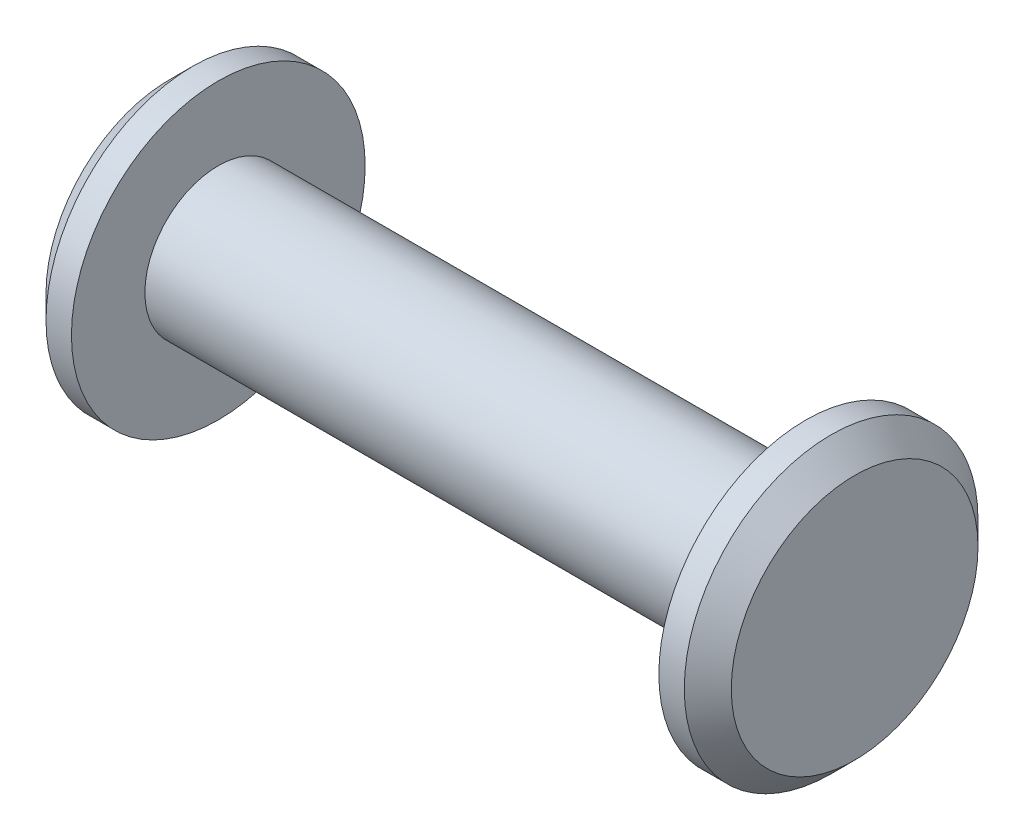
ISO-10303-21;
HEADER;
FILE_DESCRIPTION(('STEP AP214'),'2;1');
FILE_NAME('part.step','',(''),(''),'','','');
FILE_SCHEMA(('AUTOMOTIVE_DESIGN { 1 0 10303 214 1 1 1 1 }'));
ENDSEC;
DATA;
#1=APPLICATION_CONTEXT('core data for automotive mechanical design processes');
#2=APPLICATION_PROTOCOL_DEFINITION('international standard','automotive_design',2000,#1);
#3=PRODUCT_CONTEXT('',#1,'mechanical');
#4=PRODUCT('Part','Part','',(#3));
#5=PRODUCT_RELATED_PRODUCT_CATEGORY('part','',(#4));
#6=PRODUCT_DEFINITION_FORMATION('','',#4);
#7=PRODUCT_DEFINITION_CONTEXT('part definition',#1,'design');
#8=PRODUCT_DEFINITION('design','',#6,#7);
#9=PRODUCT_DEFINITION_SHAPE('','',#8);
#10=(LENGTH_UNIT() NAMED_UNIT(*) SI_UNIT(.MILLI.,.METRE.));
#11=(NAMED_UNIT(*) PLANE_ANGLE_UNIT() SI_UNIT($,.RADIAN.));
#12=(NAMED_UNIT(*) SI_UNIT($,.STERADIAN.) SOLID_ANGLE_UNIT());
#13=UNCERTAINTY_MEASURE_WITH_UNIT(LENGTH_MEASURE(1.E-05),#10,'distance_accuracy_value','');
#14=(GEOMETRIC_REPRESENTATION_CONTEXT(3) GLOBAL_UNCERTAINTY_ASSIGNED_CONTEXT((#13)) GLOBAL_UNIT_ASSIGNED_CONTEXT((#10,
#11,#12)) REPRESENTATION_CONTEXT('',''));
#15=CARTESIAN_POINT('',(0.,0.,0.));
#16=DIRECTION('',(0.,0.,1.));
#17=DIRECTION('',(1.,0.,0.));
#18=AXIS2_PLACEMENT_3D('',#15,#16,#17);
#19=CARTESIAN_POINT('',(0.,0.,0.));
#20=DIRECTION('',(-1.,0.,0.));
#21=DIRECTION('',(0.,0.,1.));
#22=AXIS2_PLACEMENT_3D('',#19,#20,#21);
#23=CYLINDRICAL_SURFACE('',#22,4.7625);
#24=CARTESIAN_POINT('',(10.3505,0.,0.));
#25=DIRECTION('',(-1.,0.,0.));
#26=DIRECTION('',(0.,0.,1.));
#27=AXIS2_PLACEMENT_3D('',#24,#25,#26);
#28=CIRCLE('',#27,4.7625);
#29=CARTESIAN_POINT('',(10.3505,0.,4.76249999999997));
#30=VERTEX_POINT('',#29);
#31=EDGE_CURVE('E46',#30,#30,#28,.T.);
#32=ORIENTED_EDGE('',*,*,#31,.T.);
#33=EDGE_LOOP('',(#32));
#34=FACE_BOUND('',#33,.T.);
#35=CARTESIAN_POINT('',(9.52499999999997,0.,0.));
#36=DIRECTION('',(-1.,0.,0.));
#37=DIRECTION('',(0.,0.,1.));
#38=AXIS2_PLACEMENT_3D('',#35,#36,#37);
#39=CIRCLE('',#38,4.7625);
#40=CARTESIAN_POINT('',(9.52499999999997,0.,4.76249999999999));
#41=VERTEX_POINT('',#40);
#42=EDGE_CURVE('E51',#41,#41,#39,.T.);
#43=ORIENTED_EDGE('',*,*,#42,.F.);
#44=EDGE_LOOP('',(#43));
#45=FACE_BOUND('',#44,.T.);
#46=ADVANCED_FACE('F32',(#34,#45),#23,.T.);
#47=CARTESIAN_POINT('',(9.52500000000001,4.7625,0.));
#48=DIRECTION('',(1.,0.,0.));
#49=DIRECTION('',(0.,0.,-1.));
#50=AXIS2_PLACEMENT_3D('',#47,#48,#49);
#51=PLANE('',#50);
#52=CARTESIAN_POINT('',(9.52499999999997,0.,0.));
#53=DIRECTION('',(-1.,0.,0.));
#54=DIRECTION('',(0.,0.,1.));
#55=AXIS2_PLACEMENT_3D('',#52,#53,#54);
#56=CIRCLE('',#55,2.38125);
#57=CARTESIAN_POINT('',(9.52499999999997,0.,2.38124999999999));
#58=VERTEX_POINT('',#57);
#59=EDGE_CURVE('E54',#58,#58,#56,.T.);
#60=ORIENTED_EDGE('',*,*,#59,.F.);
#61=EDGE_LOOP('',(#60));
#62=FACE_BOUND('',#61,.T.);
#63=ORIENTED_EDGE('',*,*,#42,.T.);
#64=EDGE_LOOP('',(#63));
#65=FACE_BOUND('',#64,.T.);
#66=ADVANCED_FACE('F77',(#62,#65),#51,.F.);
#67=CARTESIAN_POINT('',(0.,0.,0.));
#68=DIRECTION('',(-1.,0.,0.));
#69=DIRECTION('',(0.,0.,1.));
#70=AXIS2_PLACEMENT_3D('',#67,#68,#69);
#71=CYLINDRICAL_SURFACE('',#70,2.38125000000002);
#72=CARTESIAN_POINT('',(-9.52500000000003,0.,0.));
#73=DIRECTION('',(-1.,0.,0.));
#74=DIRECTION('',(0.,0.,1.));
#75=AXIS2_PLACEMENT_3D('',#72,#73,#74);
#76=CIRCLE('',#75,2.38125000000005);
#77=CARTESIAN_POINT('',(-9.52500000000003,0.,2.38125000000002));
#78=VERTEX_POINT('',#77);
#79=EDGE_CURVE('E57',#78,#78,#76,.T.);
#80=ORIENTED_EDGE('',*,*,#79,.F.);
#81=EDGE_LOOP('',(#80));
#82=FACE_BOUND('',#81,.T.);
#83=ORIENTED_EDGE('',*,*,#59,.T.);
#84=EDGE_LOOP('',(#83));
#85=FACE_BOUND('',#84,.T.);
#86=ADVANCED_FACE('F68',(#82,#85),#71,.T.);
#87=CARTESIAN_POINT('',(-9.52499999999999,4.76249999999999,0.));
#88=DIRECTION('',(1.,0.,0.));
#89=DIRECTION('',(0.,0.,-1.));
#90=AXIS2_PLACEMENT_3D('',#87,#88,#89);
#91=PLANE('',#90);
#92=ORIENTED_EDGE('',*,*,#79,.T.);
#93=EDGE_LOOP('',(#92));
#94=FACE_BOUND('',#93,.T.);
#95=CARTESIAN_POINT('',(-9.52500000000003,0.,0.));
#96=DIRECTION('',(-1.,0.,0.));
#97=DIRECTION('',(0.,0.,1.));
#98=AXIS2_PLACEMENT_3D('',#95,#96,#97);
#99=CIRCLE('',#98,4.7625);
#100=CARTESIAN_POINT('',(-9.52500000000003,0.,4.76249999999997));
#101=VERTEX_POINT('',#100);
#102=EDGE_CURVE('E60',#101,#101,#99,.T.);
#103=ORIENTED_EDGE('',*,*,#102,.F.);
#104=EDGE_LOOP('',(#103));
#105=FACE_BOUND('',#104,.T.);
#106=ADVANCED_FACE('F66',(#94,#105),#91,.T.);
#107=CARTESIAN_POINT('',(0.,0.,0.));
#108=DIRECTION('',(-1.,0.,0.));
#109=DIRECTION('',(0.,0.,1.));
#110=AXIS2_PLACEMENT_3D('',#107,#108,#109);
#111=CYLINDRICAL_SURFACE('',#110,4.7625);
#112=CARTESIAN_POINT('',(-10.3505,0.,0.));
#113=DIRECTION('',(-1.,0.,0.));
#114=DIRECTION('',(0.,0.,1.));
#115=AXIS2_PLACEMENT_3D('',#112,#113,#114);
#116=CIRCLE('',#115,4.7625);
#117=CARTESIAN_POINT('',(-10.3505,0.,4.76249999999997));
#118=VERTEX_POINT('',#117);
#119=EDGE_CURVE('E10',#118,#118,#116,.F.);
#120=ORIENTED_EDGE('',*,*,#119,.T.);
#121=EDGE_LOOP('',(#120));
#122=FACE_BOUND('',#121,.T.);
#123=ORIENTED_EDGE('',*,*,#102,.T.);
#124=EDGE_LOOP('',(#123));
#125=FACE_BOUND('',#124,.T.);
#126=ADVANCED_FACE('F64',(#122,#125),#111,.T.);
#127=CARTESIAN_POINT('',(-11.1125,0.,0.));
#128=DIRECTION('',(-1.,0.,0.));
#129=DIRECTION('',(0.,0.,1.));
#130=AXIS2_PLACEMENT_3D('',#127,#128,#129);
#131=PLANE('',#130);
#132=CARTESIAN_POINT('',(-11.1125,0.,0.));
#133=DIRECTION('',(-1.,0.,0.));
#134=DIRECTION('',(0.,0.,1.));
#135=AXIS2_PLACEMENT_3D('',#132,#133,#134);
#136=CIRCLE('',#135,4.00049999999999);
#137=CARTESIAN_POINT('',(-11.1125,0.,4.00049999999999));
#138=VERTEX_POINT('',#137);
#139=EDGE_CURVE('E38',#138,#138,#136,.T.);
#140=ORIENTED_EDGE('',*,*,#139,.T.);
#141=EDGE_LOOP('',(#140));
#142=FACE_BOUND('',#141,.T.);
#143=ADVANCED_FACE('F75',(#142),#131,.T.);
#144=CARTESIAN_POINT('',(11.1125,0.,0.));
#145=DIRECTION('',(-1.,0.,0.));
#146=DIRECTION('',(0.,0.,1.));
#147=AXIS2_PLACEMENT_3D('',#144,#145,#146);
#148=PLANE('',#147);
#149=CARTESIAN_POINT('',(11.1125,0.,0.));
#150=DIRECTION('',(-1.,0.,0.));
#151=DIRECTION('',(0.,0.,1.));
#152=AXIS2_PLACEMENT_3D('',#149,#150,#151);
#153=CIRCLE('',#152,4.00049999999999);
#154=CARTESIAN_POINT('',(11.1125,0.,4.00049999999999));
#155=VERTEX_POINT('',#154);
#156=EDGE_CURVE('E42',#155,#155,#153,.F.);
#157=ORIENTED_EDGE('',*,*,#156,.T.);
#158=EDGE_LOOP('',(#157));
#159=FACE_BOUND('',#158,.T.);
#160=ADVANCED_FACE('F94',(#159),#148,.F.);
#161=CARTESIAN_POINT('',(10.3505,0.,0.));
#162=DIRECTION('',(-1.,0.,0.));
#163=DIRECTION('',(0.,0.,1.));
#164=AXIS2_PLACEMENT_3D('',#161,#162,#163);
#165=CONICAL_SURFACE('',#164,4.7625,0.785398163397443);
#166=ORIENTED_EDGE('',*,*,#156,.F.);
#167=EDGE_LOOP('',(#166));
#168=FACE_BOUND('',#167,.T.);
#169=ORIENTED_EDGE('',*,*,#31,.F.);
#170=EDGE_LOOP('',(#169));
#171=FACE_BOUND('',#170,.T.);
#172=ADVANCED_FACE('F91',(#168,#171),#165,.T.);
#173=CARTESIAN_POINT('',(-11.1125,0.,0.));
#174=DIRECTION('',(1.,0.,0.));
#175=DIRECTION('',(0.,0.,-1.));
#176=AXIS2_PLACEMENT_3D('',#173,#174,#175);
#177=CONICAL_SURFACE('',#176,4.00049999999999,0.785398163397453);
#178=ORIENTED_EDGE('',*,*,#119,.F.);
#179=EDGE_LOOP('',(#178));
#180=FACE_BOUND('',#179,.T.);
#181=ORIENTED_EDGE('',*,*,#139,.F.);
#182=EDGE_LOOP('',(#181));
#183=FACE_BOUND('',#182,.T.);
#184=ADVANCED_FACE('F93',(#180,#183),#177,.T.);
#185=CLOSED_SHELL('',(#46,#66,#86,#106,#126,#143,#160,#172,#184));
#186=MANIFOLD_SOLID_BREP('B2',#185);
#187=ADVANCED_BREP_SHAPE_REPRESENTATION('',(#18,#186),#14);
#188=SHAPE_DEFINITION_REPRESENTATION(#9,#187);
ENDSEC;
END-ISO-10303-21;
